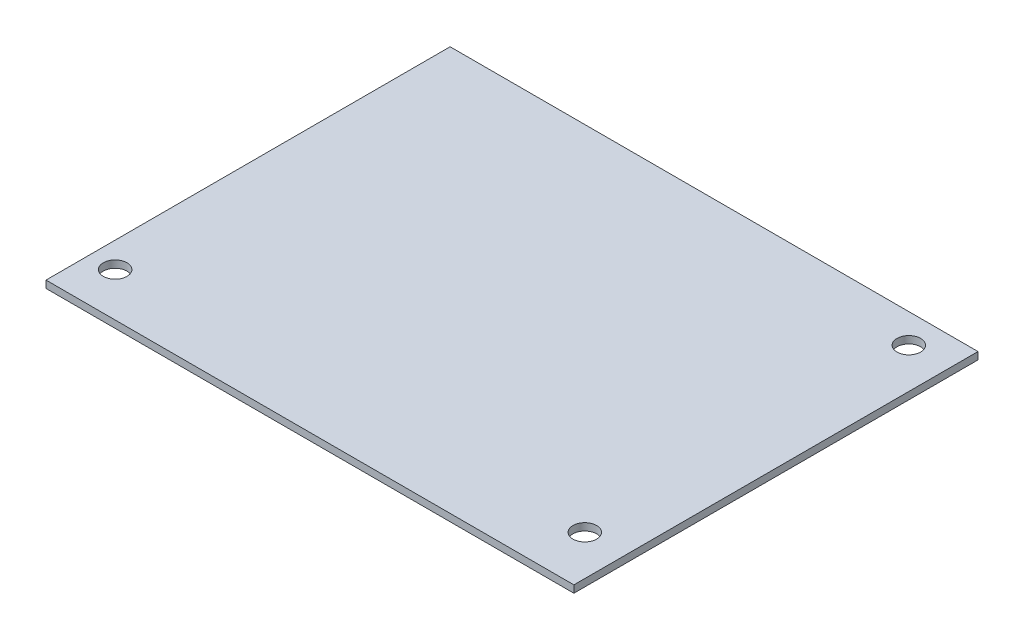
ISO-10303-21;
HEADER;
FILE_DESCRIPTION(('STEP AP214'),'2;1');
FILE_NAME('part.step','',(''),(''),'','','');
FILE_SCHEMA(('AUTOMOTIVE_DESIGN { 1 0 10303 214 1 1 1 1 }'));
ENDSEC;
DATA;
#1=APPLICATION_CONTEXT('core data for automotive mechanical design processes');
#2=APPLICATION_PROTOCOL_DEFINITION('international standard','automotive_design',2000,#1);
#3=PRODUCT_CONTEXT('',#1,'mechanical');
#4=PRODUCT('Part','Part','',(#3));
#5=PRODUCT_RELATED_PRODUCT_CATEGORY('part','',(#4));
#6=PRODUCT_DEFINITION_FORMATION('','',#4);
#7=PRODUCT_DEFINITION_CONTEXT('part definition',#1,'design');
#8=PRODUCT_DEFINITION('design','',#6,#7);
#9=PRODUCT_DEFINITION_SHAPE('','',#8);
#10=(LENGTH_UNIT() NAMED_UNIT(*) SI_UNIT(.MILLI.,.METRE.));
#11=(NAMED_UNIT(*) PLANE_ANGLE_UNIT() SI_UNIT($,.RADIAN.));
#12=(NAMED_UNIT(*) SI_UNIT($,.STERADIAN.) SOLID_ANGLE_UNIT());
#13=UNCERTAINTY_MEASURE_WITH_UNIT(LENGTH_MEASURE(1.E-05),#10,'distance_accuracy_value','');
#14=(GEOMETRIC_REPRESENTATION_CONTEXT(3) GLOBAL_UNCERTAINTY_ASSIGNED_CONTEXT((#13)) GLOBAL_UNIT_ASSIGNED_CONTEXT((#10,
#11,#12)) REPRESENTATION_CONTEXT('',''));
#15=CARTESIAN_POINT('',(0.,0.,0.));
#16=DIRECTION('',(0.,0.,1.));
#17=DIRECTION('',(1.,0.,0.));
#18=AXIS2_PLACEMENT_3D('',#15,#16,#17);
#19=CARTESIAN_POINT('',(0.,2.,0.));
#20=DIRECTION('',(0.,1.,0.));
#21=DIRECTION('',(0.,0.,1.));
#22=AXIS2_PLACEMENT_3D('',#19,#20,#21);
#23=PLANE('',#22);
#24=CARTESIAN_POINT('',(-11.,2.,-14.));
#25=DIRECTION('',(0.,1.,0.));
#26=DIRECTION('',(0.,0.,1.));
#27=AXIS2_PLACEMENT_3D('',#24,#25,#26);
#28=CIRCLE('',#27,3.25);
#29=CARTESIAN_POINT('',(-11.,2.,-10.75));
#30=VERTEX_POINT('',#29);
#31=EDGE_CURVE('E140',#30,#30,#28,.T.);
#32=ORIENTED_EDGE('',*,*,#31,.F.);
#33=EDGE_LOOP('',(#32));
#34=FACE_BOUND('',#33,.T.);
#35=DIRECTION('',(0.,0.,-1.));
#36=VECTOR('',#35,1.);
#37=CARTESIAN_POINT('',(0.,2.,0.));
#38=LINE('',#37,#36);
#39=CARTESIAN_POINT('',(0.,2.,0.));
#40=VERTEX_POINT('',#39);
#41=CARTESIAN_POINT('',(0.,2.,-111.));
#42=VERTEX_POINT('',#41);
#43=EDGE_CURVE('E98',#40,#42,#38,.T.);
#44=ORIENTED_EDGE('',*,*,#43,.T.);
#45=DIRECTION('',(-1.,0.,0.));
#46=VECTOR('',#45,1.);
#47=CARTESIAN_POINT('',(0.,2.,-111.));
#48=LINE('',#47,#46);
#49=CARTESIAN_POINT('',(-145.,2.,-111.));
#50=VERTEX_POINT('',#49);
#51=EDGE_CURVE('E93',#42,#50,#48,.T.);
#52=ORIENTED_EDGE('',*,*,#51,.T.);
#53=DIRECTION('',(0.,0.,1.));
#54=VECTOR('',#53,1.);
#55=CARTESIAN_POINT('',(-145.,2.,0.));
#56=LINE('',#55,#54);
#57=CARTESIAN_POINT('',(-145.,2.,0.));
#58=VERTEX_POINT('',#57);
#59=EDGE_CURVE('E96',#50,#58,#56,.T.);
#60=ORIENTED_EDGE('',*,*,#59,.T.);
#61=DIRECTION('',(1.,0.,0.));
#62=VECTOR('',#61,1.);
#63=CARTESIAN_POINT('',(0.,2.,0.));
#64=LINE('',#63,#62);
#65=EDGE_CURVE('E63',#58,#40,#64,.T.);
#66=ORIENTED_EDGE('',*,*,#65,.T.);
#67=EDGE_LOOP('',(#44,#52,#60,#66));
#68=FACE_BOUND('',#67,.T.);
#69=CARTESIAN_POINT('',(-138.,2.,-12.));
#70=DIRECTION('',(0.,1.,0.));
#71=DIRECTION('',(0.,0.,1.));
#72=AXIS2_PLACEMENT_3D('',#69,#70,#71);
#73=CIRCLE('',#72,3.25000000000001);
#74=CARTESIAN_POINT('',(-138.,2.,-8.74999999999998));
#75=VERTEX_POINT('',#74);
#76=EDGE_CURVE('E118',#75,#75,#73,.T.);
#77=ORIENTED_EDGE('',*,*,#76,.F.);
#78=EDGE_LOOP('',(#77));
#79=FACE_BOUND('',#78,.T.);
#80=CARTESIAN_POINT('',(-11.,2.,-103.));
#81=DIRECTION('',(0.,1.,0.));
#82=DIRECTION('',(0.,0.,1.));
#83=AXIS2_PLACEMENT_3D('',#80,#81,#82);
#84=CIRCLE('',#83,3.25);
#85=CARTESIAN_POINT('',(-11.,2.,-99.75));
#86=VERTEX_POINT('',#85);
#87=EDGE_CURVE('E148',#86,#86,#84,.T.);
#88=ORIENTED_EDGE('',*,*,#87,.F.);
#89=EDGE_LOOP('',(#88));
#90=FACE_BOUND('',#89,.T.);
#91=ADVANCED_FACE('F45',(#34,#68,#79,#90),#23,.T.);
#92=CARTESIAN_POINT('',(0.,0.,0.));
#93=DIRECTION('',(0.,1.,0.));
#94=DIRECTION('',(0.,0.,1.));
#95=AXIS2_PLACEMENT_3D('',#92,#93,#94);
#96=PLANE('',#95);
#97=DIRECTION('',(0.,0.,-1.));
#98=VECTOR('',#97,1.);
#99=CARTESIAN_POINT('',(0.,0.,0.));
#100=LINE('',#99,#98);
#101=CARTESIAN_POINT('',(0.,0.,0.));
#102=VERTEX_POINT('',#101);
#103=CARTESIAN_POINT('',(0.,0.,-111.));
#104=VERTEX_POINT('',#103);
#105=EDGE_CURVE('E114',#102,#104,#100,.T.);
#106=ORIENTED_EDGE('',*,*,#105,.F.);
#107=DIRECTION('',(1.,0.,0.));
#108=VECTOR('',#107,1.);
#109=CARTESIAN_POINT('',(0.,0.,0.));
#110=LINE('',#109,#108);
#111=CARTESIAN_POINT('',(-145.,0.,0.));
#112=VERTEX_POINT('',#111);
#113=EDGE_CURVE('E86',#112,#102,#110,.T.);
#114=ORIENTED_EDGE('',*,*,#113,.F.);
#115=DIRECTION('',(0.,0.,1.));
#116=VECTOR('',#115,1.);
#117=CARTESIAN_POINT('',(-145.,0.,0.));
#118=LINE('',#117,#116);
#119=CARTESIAN_POINT('',(-145.,0.,-111.));
#120=VERTEX_POINT('',#119);
#121=EDGE_CURVE('E80',#120,#112,#118,.T.);
#122=ORIENTED_EDGE('',*,*,#121,.F.);
#123=DIRECTION('',(-1.,0.,0.));
#124=VECTOR('',#123,1.);
#125=CARTESIAN_POINT('',(0.,0.,-111.));
#126=LINE('',#125,#124);
#127=EDGE_CURVE('E103',#104,#120,#126,.T.);
#128=ORIENTED_EDGE('',*,*,#127,.F.);
#129=EDGE_LOOP('',(#106,#114,#122,#128));
#130=FACE_BOUND('',#129,.T.);
#131=CARTESIAN_POINT('',(-138.,0.,-12.));
#132=DIRECTION('',(0.,1.,0.));
#133=DIRECTION('',(0.,0.,1.));
#134=AXIS2_PLACEMENT_3D('',#131,#132,#133);
#135=CIRCLE('',#134,3.25000000000001);
#136=CARTESIAN_POINT('',(-138.,0.,-8.74999999999998));
#137=VERTEX_POINT('',#136);
#138=EDGE_CURVE('E136',#137,#137,#135,.T.);
#139=ORIENTED_EDGE('',*,*,#138,.T.);
#140=EDGE_LOOP('',(#139));
#141=FACE_BOUND('',#140,.T.);
#142=CARTESIAN_POINT('',(-11.,0.,-14.));
#143=DIRECTION('',(0.,1.,0.));
#144=DIRECTION('',(0.,0.,1.));
#145=AXIS2_PLACEMENT_3D('',#142,#143,#144);
#146=CIRCLE('',#145,3.25);
#147=CARTESIAN_POINT('',(-11.,0.,-10.75));
#148=VERTEX_POINT('',#147);
#149=EDGE_CURVE('E144',#148,#148,#146,.T.);
#150=ORIENTED_EDGE('',*,*,#149,.T.);
#151=EDGE_LOOP('',(#150));
#152=FACE_BOUND('',#151,.T.);
#153=CARTESIAN_POINT('',(-11.,0.,-103.));
#154=DIRECTION('',(0.,1.,0.));
#155=DIRECTION('',(0.,0.,1.));
#156=AXIS2_PLACEMENT_3D('',#153,#154,#155);
#157=CIRCLE('',#156,3.25);
#158=CARTESIAN_POINT('',(-11.,0.,-99.75));
#159=VERTEX_POINT('',#158);
#160=EDGE_CURVE('E152',#159,#159,#157,.T.);
#161=ORIENTED_EDGE('',*,*,#160,.T.);
#162=EDGE_LOOP('',(#161));
#163=FACE_BOUND('',#162,.T.);
#164=ADVANCED_FACE('F131',(#130,#141,#152,#163),#96,.F.);
#165=CARTESIAN_POINT('',(0.,2.,0.));
#166=DIRECTION('',(-1.,0.,0.));
#167=DIRECTION('',(0.,0.,1.));
#168=AXIS2_PLACEMENT_3D('',#165,#166,#167);
#169=PLANE('',#168);
#170=ORIENTED_EDGE('',*,*,#105,.T.);
#171=DIRECTION('',(0.,-1.,0.));
#172=VECTOR('',#171,1.);
#173=CARTESIAN_POINT('',(0.,2.,-111.));
#174=LINE('',#173,#172);
#175=EDGE_CURVE('E11',#42,#104,#174,.T.);
#176=ORIENTED_EDGE('',*,*,#175,.F.);
#177=ORIENTED_EDGE('',*,*,#43,.F.);
#178=DIRECTION('',(0.,-1.,0.));
#179=VECTOR('',#178,1.);
#180=CARTESIAN_POINT('',(0.,2.,0.));
#181=LINE('',#180,#179);
#182=EDGE_CURVE('E110',#40,#102,#181,.T.);
#183=ORIENTED_EDGE('',*,*,#182,.T.);
#184=EDGE_LOOP('',(#170,#176,#177,#183));
#185=FACE_BOUND('',#184,.T.);
#186=ADVANCED_FACE('F47',(#185),#169,.F.);
#187=CARTESIAN_POINT('',(0.,2.,-111.));
#188=DIRECTION('',(0.,0.,1.));
#189=DIRECTION('',(1.,0.,0.));
#190=AXIS2_PLACEMENT_3D('',#187,#188,#189);
#191=PLANE('',#190);
#192=ORIENTED_EDGE('',*,*,#127,.T.);
#193=DIRECTION('',(0.,-1.,0.));
#194=VECTOR('',#193,1.);
#195=CARTESIAN_POINT('',(-145.,2.,-111.));
#196=LINE('',#195,#194);
#197=EDGE_CURVE('E55',#50,#120,#196,.T.);
#198=ORIENTED_EDGE('',*,*,#197,.F.);
#199=ORIENTED_EDGE('',*,*,#51,.F.);
#200=ORIENTED_EDGE('',*,*,#175,.T.);
#201=EDGE_LOOP('',(#192,#198,#199,#200));
#202=FACE_BOUND('',#201,.T.);
#203=ADVANCED_FACE('F102',(#202),#191,.F.);
#204=CARTESIAN_POINT('',(-145.,2.,0.));
#205=DIRECTION('',(1.,0.,0.));
#206=DIRECTION('',(0.,0.,-1.));
#207=AXIS2_PLACEMENT_3D('',#204,#205,#206);
#208=PLANE('',#207);
#209=ORIENTED_EDGE('',*,*,#121,.T.);
#210=DIRECTION('',(0.,-1.,0.));
#211=VECTOR('',#210,1.);
#212=CARTESIAN_POINT('',(-145.,2.,0.));
#213=LINE('',#212,#211);
#214=EDGE_CURVE('E105',#58,#112,#213,.T.);
#215=ORIENTED_EDGE('',*,*,#214,.F.);
#216=ORIENTED_EDGE('',*,*,#59,.F.);
#217=ORIENTED_EDGE('',*,*,#197,.T.);
#218=EDGE_LOOP('',(#209,#215,#216,#217));
#219=FACE_BOUND('',#218,.T.);
#220=ADVANCED_FACE('F106',(#219),#208,.F.);
#221=CARTESIAN_POINT('',(0.,2.,0.));
#222=DIRECTION('',(0.,0.,-1.));
#223=DIRECTION('',(-1.,0.,0.));
#224=AXIS2_PLACEMENT_3D('',#221,#222,#223);
#225=PLANE('',#224);
#226=ORIENTED_EDGE('',*,*,#113,.T.);
#227=ORIENTED_EDGE('',*,*,#182,.F.);
#228=ORIENTED_EDGE('',*,*,#65,.F.);
#229=ORIENTED_EDGE('',*,*,#214,.T.);
#230=EDGE_LOOP('',(#226,#227,#228,#229));
#231=FACE_BOUND('',#230,.T.);
#232=ADVANCED_FACE('F128',(#231),#225,.F.);
#233=CARTESIAN_POINT('',(-138.,2.,-12.));
#234=DIRECTION('',(0.,-1.,0.));
#235=DIRECTION('',(0.,0.,-1.));
#236=AXIS2_PLACEMENT_3D('',#233,#234,#235);
#237=CYLINDRICAL_SURFACE('',#236,3.25000000000001);
#238=ORIENTED_EDGE('',*,*,#76,.T.);
#239=EDGE_LOOP('',(#238));
#240=FACE_BOUND('',#239,.T.);
#241=ORIENTED_EDGE('',*,*,#138,.F.);
#242=EDGE_LOOP('',(#241));
#243=FACE_BOUND('',#242,.T.);
#244=ADVANCED_FACE('F172',(#240,#243),#237,.F.);
#245=CARTESIAN_POINT('',(-11.,2.,-14.));
#246=DIRECTION('',(0.,-1.,0.));
#247=DIRECTION('',(0.,0.,-1.));
#248=AXIS2_PLACEMENT_3D('',#245,#246,#247);
#249=CYLINDRICAL_SURFACE('',#248,3.25);
#250=ORIENTED_EDGE('',*,*,#31,.T.);
#251=EDGE_LOOP('',(#250));
#252=FACE_BOUND('',#251,.T.);
#253=ORIENTED_EDGE('',*,*,#149,.F.);
#254=EDGE_LOOP('',(#253));
#255=FACE_BOUND('',#254,.T.);
#256=ADVANCED_FACE('F217',(#252,#255),#249,.F.);
#257=CARTESIAN_POINT('',(-11.,2.,-103.));
#258=DIRECTION('',(0.,-1.,0.));
#259=DIRECTION('',(0.,0.,-1.));
#260=AXIS2_PLACEMENT_3D('',#257,#258,#259);
#261=CYLINDRICAL_SURFACE('',#260,3.25);
#262=ORIENTED_EDGE('',*,*,#87,.T.);
#263=EDGE_LOOP('',(#262));
#264=FACE_BOUND('',#263,.T.);
#265=ORIENTED_EDGE('',*,*,#160,.F.);
#266=EDGE_LOOP('',(#265));
#267=FACE_BOUND('',#266,.T.);
#268=ADVANCED_FACE('F160',(#264,#267),#261,.F.);
#269=CLOSED_SHELL('',(#91,#164,#186,#203,#220,#232,#244,#256,#268));
#270=MANIFOLD_SOLID_BREP('B2',#269);
#271=ADVANCED_BREP_SHAPE_REPRESENTATION('',(#18,#270),#14);
#272=SHAPE_DEFINITION_REPRESENTATION(#9,#271);
ENDSEC;
END-ISO-10303-21;
